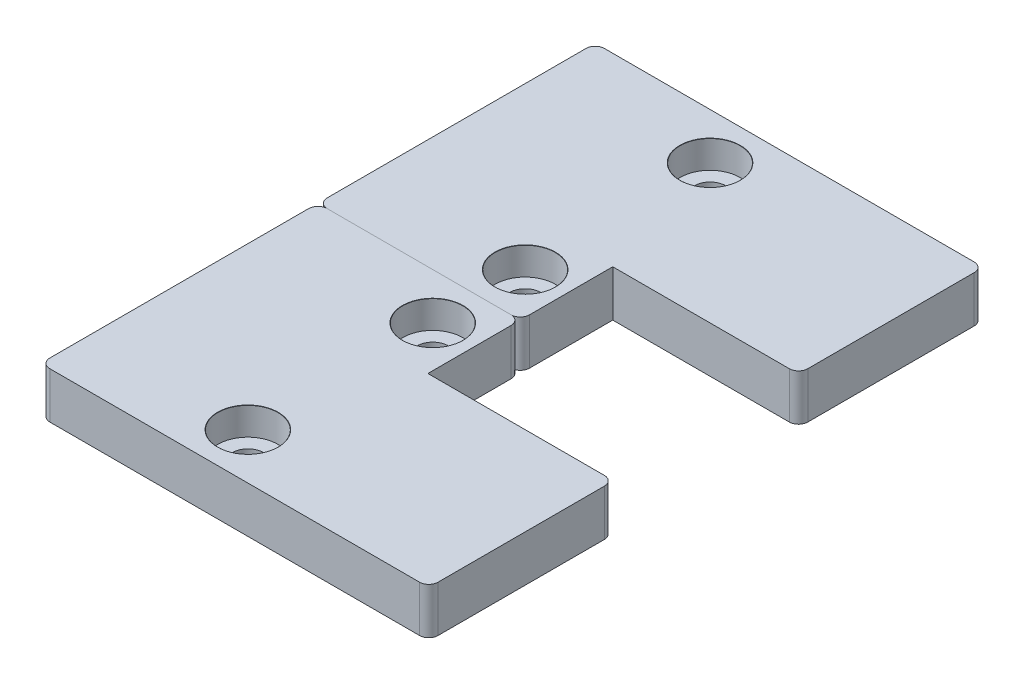
ISO-10303-21;
HEADER;
FILE_DESCRIPTION(('STEP AP214'),'2;1');
FILE_NAME('part.step','',(''),(''),'','','');
FILE_SCHEMA(('AUTOMOTIVE_DESIGN { 1 0 10303 214 1 1 1 1 }'));
ENDSEC;
DATA;
#1=APPLICATION_CONTEXT('core data for automotive mechanical design processes');
#2=APPLICATION_PROTOCOL_DEFINITION('international standard','automotive_design',2000,#1);
#3=PRODUCT_CONTEXT('',#1,'mechanical');
#4=PRODUCT('Part','Part','',(#3));
#5=PRODUCT_RELATED_PRODUCT_CATEGORY('part','',(#4));
#6=PRODUCT_DEFINITION_FORMATION('','',#4);
#7=PRODUCT_DEFINITION_CONTEXT('part definition',#1,'design');
#8=PRODUCT_DEFINITION('design','',#6,#7);
#9=PRODUCT_DEFINITION_SHAPE('','',#8);
#10=(LENGTH_UNIT() NAMED_UNIT(*) SI_UNIT(.MILLI.,.METRE.));
#11=(NAMED_UNIT(*) PLANE_ANGLE_UNIT() SI_UNIT($,.RADIAN.));
#12=(NAMED_UNIT(*) SI_UNIT($,.STERADIAN.) SOLID_ANGLE_UNIT());
#13=UNCERTAINTY_MEASURE_WITH_UNIT(LENGTH_MEASURE(1.E-05),#10,'distance_accuracy_value','');
#14=(GEOMETRIC_REPRESENTATION_CONTEXT(3) GLOBAL_UNCERTAINTY_ASSIGNED_CONTEXT((#13)) GLOBAL_UNIT_ASSIGNED_CONTEXT((#10,
#11,#12)) REPRESENTATION_CONTEXT('',''));
#15=CARTESIAN_POINT('',(0.,0.,0.));
#16=DIRECTION('',(0.,0.,1.));
#17=DIRECTION('',(1.,0.,0.));
#18=AXIS2_PLACEMENT_3D('',#15,#16,#17);
#19=CARTESIAN_POINT('',(-21.,5.,-30.));
#20=DIRECTION('',(1.,0.,0.));
#21=DIRECTION('',(0.,0.,1.));
#22=AXIS2_PLACEMENT_3D('',#19,#20,#21);
#23=PLANE('',#22);
#24=DIRECTION('',(0.,0.,-1.));
#25=VECTOR('',#24,1.);
#26=CARTESIAN_POINT('',(-21.,5.,-30.));
#27=LINE('',#26,#25);
#28=CARTESIAN_POINT('',(-21.,5.,-21.));
#29=VERTEX_POINT('',#28);
#30=CARTESIAN_POINT('',(-21.,5.,-49.));
#31=VERTEX_POINT('',#30);
#32=EDGE_CURVE('E155',#29,#31,#27,.T.);
#33=ORIENTED_EDGE('',*,*,#32,.T.);
#34=DIRECTION('',(0.,-1.,0.));
#35=VECTOR('',#34,1.);
#36=CARTESIAN_POINT('',(-21.,5.,-49.));
#37=LINE('',#36,#35);
#38=CARTESIAN_POINT('',(-21.,0.,-49.));
#39=VERTEX_POINT('',#38);
#40=EDGE_CURVE('E196',#39,#31,#37,.F.);
#41=ORIENTED_EDGE('',*,*,#40,.F.);
#42=DIRECTION('',(0.,0.,-1.));
#43=VECTOR('',#42,1.);
#44=CARTESIAN_POINT('',(-21.,0.,-30.));
#45=LINE('',#44,#43);
#46=CARTESIAN_POINT('',(-21.,0.,-21.));
#47=VERTEX_POINT('',#46);
#48=EDGE_CURVE('E161',#47,#39,#45,.T.);
#49=ORIENTED_EDGE('',*,*,#48,.F.);
#50=DIRECTION('',(0.,1.,0.));
#51=VECTOR('',#50,1.);
#52=CARTESIAN_POINT('',(-21.,0.,-21.));
#53=LINE('',#52,#51);
#54=EDGE_CURVE('E199',#29,#47,#53,.F.);
#55=ORIENTED_EDGE('',*,*,#54,.F.);
#56=EDGE_LOOP('',(#33,#41,#49,#55));
#57=FACE_BOUND('',#56,.T.);
#58=ADVANCED_FACE('F50',(#57),#23,.F.);
#59=CARTESIAN_POINT('',(21.,5.,-50.));
#60=DIRECTION('',(0.,0.,1.));
#61=DIRECTION('',(-1.,0.,0.));
#62=AXIS2_PLACEMENT_3D('',#59,#60,#61);
#63=PLANE('',#62);
#64=DIRECTION('',(1.,0.,0.));
#65=VECTOR('',#64,1.);
#66=CARTESIAN_POINT('',(21.,0.,-50.));
#67=LINE('',#66,#65);
#68=CARTESIAN_POINT('',(-20.,0.,-50.));
#69=VERTEX_POINT('',#68);
#70=CARTESIAN_POINT('',(20.,0.,-50.));
#71=VERTEX_POINT('',#70);
#72=EDGE_CURVE('E163',#69,#71,#67,.T.);
#73=ORIENTED_EDGE('',*,*,#72,.F.);
#74=DIRECTION('',(0.,-1.,0.));
#75=VECTOR('',#74,1.);
#76=CARTESIAN_POINT('',(-20.,5.,-50.));
#77=LINE('',#76,#75);
#78=CARTESIAN_POINT('',(-20.,5.,-50.));
#79=VERTEX_POINT('',#78);
#80=EDGE_CURVE('E58',#79,#69,#77,.T.);
#81=ORIENTED_EDGE('',*,*,#80,.F.);
#82=DIRECTION('',(1.,0.,0.));
#83=VECTOR('',#82,1.);
#84=CARTESIAN_POINT('',(21.,5.,-50.));
#85=LINE('',#84,#83);
#86=CARTESIAN_POINT('',(20.,5.,-50.));
#87=VERTEX_POINT('',#86);
#88=EDGE_CURVE('E172',#79,#87,#85,.T.);
#89=ORIENTED_EDGE('',*,*,#88,.T.);
#90=DIRECTION('',(0.,-1.,0.));
#91=VECTOR('',#90,1.);
#92=CARTESIAN_POINT('',(20.,5.,-50.));
#93=LINE('',#92,#91);
#94=EDGE_CURVE('E12',#71,#87,#93,.F.);
#95=ORIENTED_EDGE('',*,*,#94,.F.);
#96=EDGE_LOOP('',(#73,#81,#89,#95));
#97=FACE_BOUND('',#96,.T.);
#98=ADVANCED_FACE('F222',(#97),#63,.F.);
#99=CARTESIAN_POINT('',(21.,5.,-30.));
#100=DIRECTION('',(-1.,0.,0.));
#101=DIRECTION('',(0.,0.,-1.));
#102=AXIS2_PLACEMENT_3D('',#99,#100,#101);
#103=PLANE('',#102);
#104=DIRECTION('',(0.,0.,1.));
#105=VECTOR('',#104,1.);
#106=CARTESIAN_POINT('',(21.,0.,-30.));
#107=LINE('',#106,#105);
#108=CARTESIAN_POINT('',(21.,0.,-49.));
#109=VERTEX_POINT('',#108);
#110=CARTESIAN_POINT('',(21.,0.,-31.));
#111=VERTEX_POINT('',#110);
#112=EDGE_CURVE('E156',#109,#111,#107,.T.);
#113=ORIENTED_EDGE('',*,*,#112,.F.);
#114=DIRECTION('',(0.,-1.,0.));
#115=VECTOR('',#114,1.);
#116=CARTESIAN_POINT('',(21.,5.,-49.));
#117=LINE('',#116,#115);
#118=CARTESIAN_POINT('',(21.,5.,-49.));
#119=VERTEX_POINT('',#118);
#120=EDGE_CURVE('E213',#119,#109,#117,.T.);
#121=ORIENTED_EDGE('',*,*,#120,.F.);
#122=DIRECTION('',(0.,0.,1.));
#123=VECTOR('',#122,1.);
#124=CARTESIAN_POINT('',(21.,5.,-30.));
#125=LINE('',#124,#123);
#126=CARTESIAN_POINT('',(21.,5.,-31.));
#127=VERTEX_POINT('',#126);
#128=EDGE_CURVE('E175',#119,#127,#125,.T.);
#129=ORIENTED_EDGE('',*,*,#128,.T.);
#130=DIRECTION('',(0.,-1.,0.));
#131=VECTOR('',#130,1.);
#132=CARTESIAN_POINT('',(21.,5.,-31.));
#133=LINE('',#132,#131);
#134=EDGE_CURVE('E215',#111,#127,#133,.F.);
#135=ORIENTED_EDGE('',*,*,#134,.F.);
#136=EDGE_LOOP('',(#113,#121,#129,#135));
#137=FACE_BOUND('',#136,.T.);
#138=ADVANCED_FACE('F229',(#137),#103,.F.);
#139=CARTESIAN_POINT('',(21.,5.,-30.));
#140=DIRECTION('',(0.,0.,-1.));
#141=DIRECTION('',(1.,0.,0.));
#142=AXIS2_PLACEMENT_3D('',#139,#140,#141);
#143=PLANE('',#142);
#144=DIRECTION('',(-1.,0.,0.));
#145=VECTOR('',#144,1.);
#146=CARTESIAN_POINT('',(21.,5.,-30.));
#147=LINE('',#146,#145);
#148=CARTESIAN_POINT('',(20.,5.,-30.));
#149=VERTEX_POINT('',#148);
#150=CARTESIAN_POINT('',(0.900000000000001,5.,-30.));
#151=VERTEX_POINT('',#150);
#152=EDGE_CURVE('E160',#149,#151,#147,.T.);
#153=ORIENTED_EDGE('',*,*,#152,.T.);
#154=DIRECTION('',(0.,1.,0.));
#155=VECTOR('',#154,1.);
#156=CARTESIAN_POINT('',(0.900000000000001,0.,-30.));
#157=LINE('',#156,#155);
#158=CARTESIAN_POINT('',(0.900000000000001,0.,-30.));
#159=VERTEX_POINT('',#158);
#160=EDGE_CURVE('E139',#159,#151,#157,.T.);
#161=ORIENTED_EDGE('',*,*,#160,.F.);
#162=DIRECTION('',(-1.,0.,0.));
#163=VECTOR('',#162,1.);
#164=CARTESIAN_POINT('',(21.,0.,-30.));
#165=LINE('',#164,#163);
#166=CARTESIAN_POINT('',(20.,0.,-30.));
#167=VERTEX_POINT('',#166);
#168=EDGE_CURVE('E148',#167,#159,#165,.T.);
#169=ORIENTED_EDGE('',*,*,#168,.F.);
#170=DIRECTION('',(0.,-1.,0.));
#171=VECTOR('',#170,1.);
#172=CARTESIAN_POINT('',(20.,5.,-30.));
#173=LINE('',#172,#171);
#174=EDGE_CURVE('E211',#149,#167,#173,.T.);
#175=ORIENTED_EDGE('',*,*,#174,.F.);
#176=EDGE_LOOP('',(#153,#161,#169,#175));
#177=FACE_BOUND('',#176,.T.);
#178=ADVANCED_FACE('F158',(#177),#143,.F.);
#179=CARTESIAN_POINT('',(0.,5.,-40.));
#180=DIRECTION('',(0.,-1.,0.));
#181=DIRECTION('',(0.,0.,1.));
#182=AXIS2_PLACEMENT_3D('',#179,#180,#181);
#183=PLANE('',#182);
#184=CARTESIAN_POINT('',(-3.575,5.,-25.));
#185=DIRECTION('',(0.,-1.,0.));
#186=DIRECTION('',(0.,0.,-1.));
#187=AXIS2_PLACEMENT_3D('',#184,#185,#186);
#188=CIRCLE('',#187,3.275);
#189=CARTESIAN_POINT('',(-3.575,5.,-28.275));
#190=VERTEX_POINT('',#189);
#191=EDGE_CURVE('E266',#190,#190,#188,.T.);
#192=ORIENTED_EDGE('',*,*,#191,.T.);
#193=EDGE_LOOP('',(#192));
#194=FACE_BOUND('',#193,.T.);
#195=CARTESIAN_POINT('',(-3.57499999999999,5.,-45.));
#196=DIRECTION('',(0.,-1.,0.));
#197=DIRECTION('',(0.,0.,-1.));
#198=AXIS2_PLACEMENT_3D('',#195,#196,#197);
#199=CIRCLE('',#198,3.275);
#200=CARTESIAN_POINT('',(-3.57499999999999,5.,-48.275));
#201=VERTEX_POINT('',#200);
#202=EDGE_CURVE('E251',#201,#201,#199,.T.);
#203=ORIENTED_EDGE('',*,*,#202,.T.);
#204=EDGE_LOOP('',(#203));
#205=FACE_BOUND('',#204,.T.);
#206=DIRECTION('',(-1.,0.,0.));
#207=VECTOR('',#206,1.);
#208=CARTESIAN_POINT('',(-21.,5.,-20.));
#209=LINE('',#208,#207);
#210=CARTESIAN_POINT('',(-0.0999999999999994,5.,-20.));
#211=VERTEX_POINT('',#210);
#212=CARTESIAN_POINT('',(-20.,5.,-20.));
#213=VERTEX_POINT('',#212);
#214=EDGE_CURVE('E145',#211,#213,#209,.T.);
#215=ORIENTED_EDGE('',*,*,#214,.F.);
#216=CARTESIAN_POINT('',(-0.0999999999999985,5.,-21.));
#217=DIRECTION('',(0.,1.,0.));
#218=DIRECTION('',(0.,0.,1.));
#219=AXIS2_PLACEMENT_3D('',#216,#217,#218);
#220=CIRCLE('',#219,1.);
#221=CARTESIAN_POINT('',(0.900000000000001,5.,-21.));
#222=VERTEX_POINT('',#221);
#223=EDGE_CURVE('E191',#222,#211,#220,.F.);
#224=ORIENTED_EDGE('',*,*,#223,.F.);
#225=DIRECTION('',(0.,0.,1.));
#226=VECTOR('',#225,1.);
#227=CARTESIAN_POINT('',(0.900000000000001,5.,-30.));
#228=LINE('',#227,#226);
#229=EDGE_CURVE('E236',#151,#222,#228,.T.);
#230=ORIENTED_EDGE('',*,*,#229,.F.);
#231=ORIENTED_EDGE('',*,*,#152,.F.);
#232=CARTESIAN_POINT('',(20.,5.,-31.));
#233=DIRECTION('',(0.,1.,0.));
#234=DIRECTION('',(0.,0.,1.));
#235=AXIS2_PLACEMENT_3D('',#232,#233,#234);
#236=CIRCLE('',#235,1.);
#237=EDGE_CURVE('E189',#127,#149,#236,.F.);
#238=ORIENTED_EDGE('',*,*,#237,.F.);
#239=ORIENTED_EDGE('',*,*,#128,.F.);
#240=CARTESIAN_POINT('',(20.,5.,-49.));
#241=DIRECTION('',(0.,1.,0.));
#242=DIRECTION('',(0.,0.,1.));
#243=AXIS2_PLACEMENT_3D('',#240,#241,#242);
#244=CIRCLE('',#243,1.);
#245=EDGE_CURVE('E187',#87,#119,#244,.F.);
#246=ORIENTED_EDGE('',*,*,#245,.F.);
#247=ORIENTED_EDGE('',*,*,#88,.F.);
#248=CARTESIAN_POINT('',(-20.,5.,-49.));
#249=DIRECTION('',(0.,1.,0.));
#250=DIRECTION('',(0.,0.,1.));
#251=AXIS2_PLACEMENT_3D('',#248,#249,#250);
#252=CIRCLE('',#251,1.);
#253=EDGE_CURVE('E185',#31,#79,#252,.F.);
#254=ORIENTED_EDGE('',*,*,#253,.F.);
#255=ORIENTED_EDGE('',*,*,#32,.F.);
#256=CARTESIAN_POINT('',(-20.,5.,-21.));
#257=DIRECTION('',(0.,1.,0.));
#258=DIRECTION('',(0.,0.,1.));
#259=AXIS2_PLACEMENT_3D('',#256,#257,#258);
#260=CIRCLE('',#259,1.);
#261=EDGE_CURVE('E194',#213,#29,#260,.F.);
#262=ORIENTED_EDGE('',*,*,#261,.F.);
#263=EDGE_LOOP('',(#215,#224,#230,#231,#238,#239,#246,#247,#254,#255,#262));
#264=FACE_BOUND('',#263,.T.);
#265=ADVANCED_FACE('F234',(#194,#205,#264),#183,.F.);
#266=CARTESIAN_POINT('',(0.,0.,-40.));
#267=DIRECTION('',(0.,-1.,0.));
#268=DIRECTION('',(0.,0.,1.));
#269=AXIS2_PLACEMENT_3D('',#266,#267,#268);
#270=PLANE('',#269);
#271=CARTESIAN_POINT('',(-3.575,0.,-25.));
#272=DIRECTION('',(0.,-1.,0.));
#273=DIRECTION('',(0.,0.,-1.));
#274=AXIS2_PLACEMENT_3D('',#271,#272,#273);
#275=CIRCLE('',#274,1.7);
#276=CARTESIAN_POINT('',(-3.575,0.,-26.7));
#277=VERTEX_POINT('',#276);
#278=EDGE_CURVE('E254',#277,#277,#275,.T.);
#279=ORIENTED_EDGE('',*,*,#278,.F.);
#280=EDGE_LOOP('',(#279));
#281=FACE_BOUND('',#280,.T.);
#282=CARTESIAN_POINT('',(-3.57499999999999,0.,-45.));
#283=DIRECTION('',(0.,-1.,0.));
#284=DIRECTION('',(0.,0.,-1.));
#285=AXIS2_PLACEMENT_3D('',#282,#283,#284);
#286=CIRCLE('',#285,1.7);
#287=CARTESIAN_POINT('',(-3.57499999999999,0.,-46.7));
#288=VERTEX_POINT('',#287);
#289=EDGE_CURVE('E237',#288,#288,#286,.T.);
#290=ORIENTED_EDGE('',*,*,#289,.F.);
#291=EDGE_LOOP('',(#290));
#292=FACE_BOUND('',#291,.T.);
#293=ORIENTED_EDGE('',*,*,#48,.T.);
#294=CARTESIAN_POINT('',(-20.,0.,-49.));
#295=DIRECTION('',(0.,1.,0.));
#296=DIRECTION('',(0.,0.,1.));
#297=AXIS2_PLACEMENT_3D('',#294,#295,#296);
#298=CIRCLE('',#297,1.);
#299=EDGE_CURVE('E72',#69,#39,#298,.T.);
#300=ORIENTED_EDGE('',*,*,#299,.F.);
#301=ORIENTED_EDGE('',*,*,#72,.T.);
#302=CARTESIAN_POINT('',(20.,0.,-49.));
#303=DIRECTION('',(0.,1.,0.));
#304=DIRECTION('',(0.,0.,1.));
#305=AXIS2_PLACEMENT_3D('',#302,#303,#304);
#306=CIRCLE('',#305,1.);
#307=EDGE_CURVE('E64',#109,#71,#306,.T.);
#308=ORIENTED_EDGE('',*,*,#307,.F.);
#309=ORIENTED_EDGE('',*,*,#112,.T.);
#310=CARTESIAN_POINT('',(20.,0.,-31.));
#311=DIRECTION('',(0.,1.,0.));
#312=DIRECTION('',(0.,0.,1.));
#313=AXIS2_PLACEMENT_3D('',#310,#311,#312);
#314=CIRCLE('',#313,1.);
#315=EDGE_CURVE('E151',#167,#111,#314,.T.);
#316=ORIENTED_EDGE('',*,*,#315,.F.);
#317=ORIENTED_EDGE('',*,*,#168,.T.);
#318=DIRECTION('',(0.,0.,1.));
#319=VECTOR('',#318,1.);
#320=CARTESIAN_POINT('',(0.900000000000001,0.,-30.));
#321=LINE('',#320,#319);
#322=CARTESIAN_POINT('',(0.900000000000001,0.,-21.));
#323=VERTEX_POINT('',#322);
#324=EDGE_CURVE('E134',#159,#323,#321,.T.);
#325=ORIENTED_EDGE('',*,*,#324,.T.);
#326=CARTESIAN_POINT('',(-0.0999999999999985,0.,-21.));
#327=DIRECTION('',(0.,1.,0.));
#328=DIRECTION('',(0.,0.,1.));
#329=AXIS2_PLACEMENT_3D('',#326,#327,#328);
#330=CIRCLE('',#329,1.);
#331=CARTESIAN_POINT('',(-0.0999999999999994,0.,-20.));
#332=VERTEX_POINT('',#331);
#333=EDGE_CURVE('E205',#332,#323,#330,.T.);
#334=ORIENTED_EDGE('',*,*,#333,.F.);
#335=DIRECTION('',(-1.,0.,0.));
#336=VECTOR('',#335,1.);
#337=CARTESIAN_POINT('',(-21.,0.,-20.));
#338=LINE('',#337,#336);
#339=CARTESIAN_POINT('',(-20.,0.,-20.));
#340=VERTEX_POINT('',#339);
#341=EDGE_CURVE('E144',#332,#340,#338,.T.);
#342=ORIENTED_EDGE('',*,*,#341,.T.);
#343=CARTESIAN_POINT('',(-20.,0.,-21.));
#344=DIRECTION('',(0.,1.,0.));
#345=DIRECTION('',(0.,0.,1.));
#346=AXIS2_PLACEMENT_3D('',#343,#344,#345);
#347=CIRCLE('',#346,1.);
#348=EDGE_CURVE('E207',#47,#340,#347,.T.);
#349=ORIENTED_EDGE('',*,*,#348,.F.);
#350=EDGE_LOOP('',(#293,#300,#301,#308,#309,#316,#317,#325,#334,#342,#349));
#351=FACE_BOUND('',#350,.T.);
#352=ADVANCED_FACE('F149',(#281,#292,#351),#270,.T.);
#353=CARTESIAN_POINT('',(-21.,0.,-20.));
#354=DIRECTION('',(0.,0.,1.));
#355=DIRECTION('',(-1.,0.,0.));
#356=AXIS2_PLACEMENT_3D('',#353,#354,#355);
#357=PLANE('',#356);
#358=ORIENTED_EDGE('',*,*,#341,.F.);
#359=DIRECTION('',(0.,1.,0.));
#360=VECTOR('',#359,1.);
#361=CARTESIAN_POINT('',(-0.0999999999999994,0.,-20.));
#362=LINE('',#361,#360);
#363=EDGE_CURVE('E178',#211,#332,#362,.F.);
#364=ORIENTED_EDGE('',*,*,#363,.F.);
#365=ORIENTED_EDGE('',*,*,#214,.T.);
#366=DIRECTION('',(0.,1.,0.));
#367=VECTOR('',#366,1.);
#368=CARTESIAN_POINT('',(-20.,5.,-20.));
#369=LINE('',#368,#367);
#370=EDGE_CURVE('E183',#340,#213,#369,.T.);
#371=ORIENTED_EDGE('',*,*,#370,.F.);
#372=EDGE_LOOP('',(#358,#364,#365,#371));
#373=FACE_BOUND('',#372,.T.);
#374=ADVANCED_FACE('F423',(#373),#357,.T.);
#375=CARTESIAN_POINT('',(0.900000000000001,0.,-30.));
#376=DIRECTION('',(1.,0.,0.));
#377=DIRECTION('',(0.,0.,1.));
#378=AXIS2_PLACEMENT_3D('',#375,#376,#377);
#379=PLANE('',#378);
#380=ORIENTED_EDGE('',*,*,#324,.F.);
#381=ORIENTED_EDGE('',*,*,#160,.T.);
#382=ORIENTED_EDGE('',*,*,#229,.T.);
#383=DIRECTION('',(0.,1.,0.));
#384=VECTOR('',#383,1.);
#385=CARTESIAN_POINT('',(0.900000000000001,0.,-21.));
#386=LINE('',#385,#384);
#387=EDGE_CURVE('E141',#323,#222,#386,.T.);
#388=ORIENTED_EDGE('',*,*,#387,.F.);
#389=EDGE_LOOP('',(#380,#381,#382,#388));
#390=FACE_BOUND('',#389,.T.);
#391=ADVANCED_FACE('F136',(#390),#379,.T.);
#392=CARTESIAN_POINT('',(-3.57499999999999,5.,-45.));
#393=DIRECTION('',(0.,1.,0.));
#394=DIRECTION('',(0.,0.,-1.));
#395=AXIS2_PLACEMENT_3D('',#392,#393,#394);
#396=CYLINDRICAL_SURFACE('',#395,1.7);
#397=ORIENTED_EDGE('',*,*,#289,.T.);
#398=EDGE_LOOP('',(#397));
#399=FACE_BOUND('',#398,.T.);
#400=CARTESIAN_POINT('',(-3.57499999999999,2.,-45.));
#401=DIRECTION('',(0.,-1.,0.));
#402=DIRECTION('',(0.,0.,-1.));
#403=AXIS2_PLACEMENT_3D('',#400,#401,#402);
#404=CIRCLE('',#403,1.7);
#405=CARTESIAN_POINT('',(-3.57499999999999,2.,-46.7));
#406=VERTEX_POINT('',#405);
#407=EDGE_CURVE('E240',#406,#406,#404,.T.);
#408=ORIENTED_EDGE('',*,*,#407,.F.);
#409=EDGE_LOOP('',(#408));
#410=FACE_BOUND('',#409,.T.);
#411=ADVANCED_FACE('F402',(#399,#410),#396,.F.);
#412=CARTESIAN_POINT('',(-0.324999999999995,2.,-45.));
#413=DIRECTION('',(0.,-1.,0.));
#414=DIRECTION('',(0.,0.,1.));
#415=AXIS2_PLACEMENT_3D('',#412,#413,#414);
#416=PLANE('',#415);
#417=ORIENTED_EDGE('',*,*,#407,.T.);
#418=EDGE_LOOP('',(#417));
#419=FACE_BOUND('',#418,.T.);
#420=CARTESIAN_POINT('',(-3.57499999999999,2.,-45.));
#421=DIRECTION('',(0.,-1.,0.));
#422=DIRECTION('',(0.,0.,-1.));
#423=AXIS2_PLACEMENT_3D('',#420,#421,#422);
#424=CIRCLE('',#423,3.25);
#425=CARTESIAN_POINT('',(-3.57499999999999,2.,-48.25));
#426=VERTEX_POINT('',#425);
#427=EDGE_CURVE('E245',#426,#426,#424,.T.);
#428=ORIENTED_EDGE('',*,*,#427,.F.);
#429=EDGE_LOOP('',(#428));
#430=FACE_BOUND('',#429,.T.);
#431=ADVANCED_FACE('F391',(#419,#430),#416,.F.);
#432=CARTESIAN_POINT('',(-3.57499999999999,5.,-45.));
#433=DIRECTION('',(0.,1.,0.));
#434=DIRECTION('',(0.,0.,-1.));
#435=AXIS2_PLACEMENT_3D('',#432,#433,#434);
#436=CYLINDRICAL_SURFACE('',#435,3.25);
#437=ORIENTED_EDGE('',*,*,#427,.T.);
#438=EDGE_LOOP('',(#437));
#439=FACE_BOUND('',#438,.T.);
#440=CARTESIAN_POINT('',(-3.57499999999999,4.97902250922057,-45.));
#441=DIRECTION('',(0.,-1.,0.));
#442=DIRECTION('',(0.,0.,-1.));
#443=AXIS2_PLACEMENT_3D('',#440,#441,#442);
#444=CIRCLE('',#443,3.25);
#445=CARTESIAN_POINT('',(-3.57499999999999,4.97902250922057,-48.25));
#446=VERTEX_POINT('',#445);
#447=EDGE_CURVE('E248',#446,#446,#444,.T.);
#448=ORIENTED_EDGE('',*,*,#447,.F.);
#449=EDGE_LOOP('',(#448));
#450=FACE_BOUND('',#449,.T.);
#451=ADVANCED_FACE('F380',(#439,#450),#436,.F.);
#452=CARTESIAN_POINT('',(-3.57499999999999,5.,-45.));
#453=DIRECTION('',(0.,1.,0.));
#454=DIRECTION('',(0.,0.,-1.));
#455=AXIS2_PLACEMENT_3D('',#452,#453,#454);
#456=CONICAL_SURFACE('',#455,3.275,0.87266462599717);
#457=ORIENTED_EDGE('',*,*,#447,.T.);
#458=EDGE_LOOP('',(#457));
#459=FACE_BOUND('',#458,.T.);
#460=ORIENTED_EDGE('',*,*,#202,.F.);
#461=EDGE_LOOP('',(#460));
#462=FACE_BOUND('',#461,.T.);
#463=ADVANCED_FACE('F369',(#459,#462),#456,.F.);
#464=CARTESIAN_POINT('',(-3.575,5.,-25.));
#465=DIRECTION('',(0.,1.,0.));
#466=DIRECTION('',(0.,0.,-1.));
#467=AXIS2_PLACEMENT_3D('',#464,#465,#466);
#468=CYLINDRICAL_SURFACE('',#467,1.7);
#469=ORIENTED_EDGE('',*,*,#278,.T.);
#470=EDGE_LOOP('',(#469));
#471=FACE_BOUND('',#470,.T.);
#472=CARTESIAN_POINT('',(-3.575,2.,-25.));
#473=DIRECTION('',(0.,-1.,0.));
#474=DIRECTION('',(0.,0.,-1.));
#475=AXIS2_PLACEMENT_3D('',#472,#473,#474);
#476=CIRCLE('',#475,1.7);
#477=CARTESIAN_POINT('',(-3.575,2.,-26.7));
#478=VERTEX_POINT('',#477);
#479=EDGE_CURVE('E257',#478,#478,#476,.T.);
#480=ORIENTED_EDGE('',*,*,#479,.F.);
#481=EDGE_LOOP('',(#480));
#482=FACE_BOUND('',#481,.T.);
#483=ADVANCED_FACE('F358',(#471,#482),#468,.F.);
#484=CARTESIAN_POINT('',(-0.325000000000001,2.,-25.));
#485=DIRECTION('',(0.,-1.,0.));
#486=DIRECTION('',(0.,0.,1.));
#487=AXIS2_PLACEMENT_3D('',#484,#485,#486);
#488=PLANE('',#487);
#489=ORIENTED_EDGE('',*,*,#479,.T.);
#490=EDGE_LOOP('',(#489));
#491=FACE_BOUND('',#490,.T.);
#492=CARTESIAN_POINT('',(-3.575,2.,-25.));
#493=DIRECTION('',(0.,-1.,0.));
#494=DIRECTION('',(0.,0.,-1.));
#495=AXIS2_PLACEMENT_3D('',#492,#493,#494);
#496=CIRCLE('',#495,3.25);
#497=CARTESIAN_POINT('',(-3.575,2.,-28.25));
#498=VERTEX_POINT('',#497);
#499=EDGE_CURVE('E260',#498,#498,#496,.T.);
#500=ORIENTED_EDGE('',*,*,#499,.F.);
#501=EDGE_LOOP('',(#500));
#502=FACE_BOUND('',#501,.T.);
#503=ADVANCED_FACE('F285',(#491,#502),#488,.F.);
#504=CARTESIAN_POINT('',(-3.575,5.,-25.));
#505=DIRECTION('',(0.,1.,0.));
#506=DIRECTION('',(0.,0.,-1.));
#507=AXIS2_PLACEMENT_3D('',#504,#505,#506);
#508=CYLINDRICAL_SURFACE('',#507,3.25);
#509=ORIENTED_EDGE('',*,*,#499,.T.);
#510=EDGE_LOOP('',(#509));
#511=FACE_BOUND('',#510,.T.);
#512=CARTESIAN_POINT('',(-3.575,4.97902250922057,-25.));
#513=DIRECTION('',(0.,-1.,0.));
#514=DIRECTION('',(0.,0.,-1.));
#515=AXIS2_PLACEMENT_3D('',#512,#513,#514);
#516=CIRCLE('',#515,3.25);
#517=CARTESIAN_POINT('',(-3.575,4.97902250922057,-28.25));
#518=VERTEX_POINT('',#517);
#519=EDGE_CURVE('E263',#518,#518,#516,.T.);
#520=ORIENTED_EDGE('',*,*,#519,.F.);
#521=EDGE_LOOP('',(#520));
#522=FACE_BOUND('',#521,.T.);
#523=ADVANCED_FACE('F275',(#511,#522),#508,.F.);
#524=CARTESIAN_POINT('',(-3.575,5.,-25.));
#525=DIRECTION('',(0.,1.,0.));
#526=DIRECTION('',(0.,0.,-1.));
#527=AXIS2_PLACEMENT_3D('',#524,#525,#526);
#528=CONICAL_SURFACE('',#527,3.275,0.87266462599717);
#529=ORIENTED_EDGE('',*,*,#519,.T.);
#530=EDGE_LOOP('',(#529));
#531=FACE_BOUND('',#530,.T.);
#532=ORIENTED_EDGE('',*,*,#191,.F.);
#533=EDGE_LOOP('',(#532));
#534=FACE_BOUND('',#533,.T.);
#535=ADVANCED_FACE('F272',(#531,#534),#528,.F.);
#536=CARTESIAN_POINT('',(-20.,0.,-21.));
#537=DIRECTION('',(0.,-1.,0.));
#538=DIRECTION('',(0.,0.,1.));
#539=AXIS2_PLACEMENT_3D('',#536,#537,#538);
#540=CYLINDRICAL_SURFACE('',#539,1.);
#541=ORIENTED_EDGE('',*,*,#348,.T.);
#542=ORIENTED_EDGE('',*,*,#370,.T.);
#543=ORIENTED_EDGE('',*,*,#261,.T.);
#544=ORIENTED_EDGE('',*,*,#54,.T.);
#545=EDGE_LOOP('',(#541,#542,#543,#544));
#546=FACE_BOUND('',#545,.T.);
#547=ADVANCED_FACE('F274',(#546),#540,.T.);
#548=CARTESIAN_POINT('',(-0.0999999999999985,0.,-21.));
#549=DIRECTION('',(0.,1.,0.));
#550=DIRECTION('',(0.,0.,-1.));
#551=AXIS2_PLACEMENT_3D('',#548,#549,#550);
#552=CYLINDRICAL_SURFACE('',#551,1.);
#553=ORIENTED_EDGE('',*,*,#333,.T.);
#554=ORIENTED_EDGE('',*,*,#387,.T.);
#555=ORIENTED_EDGE('',*,*,#223,.T.);
#556=ORIENTED_EDGE('',*,*,#363,.T.);
#557=EDGE_LOOP('',(#553,#554,#555,#556));
#558=FACE_BOUND('',#557,.T.);
#559=ADVANCED_FACE('F282',(#558),#552,.T.);
#560=CARTESIAN_POINT('',(20.,5.,-31.));
#561=DIRECTION('',(0.,-1.,0.));
#562=DIRECTION('',(0.,0.,1.));
#563=AXIS2_PLACEMENT_3D('',#560,#561,#562);
#564=CYLINDRICAL_SURFACE('',#563,1.);
#565=ORIENTED_EDGE('',*,*,#237,.T.);
#566=ORIENTED_EDGE('',*,*,#174,.T.);
#567=ORIENTED_EDGE('',*,*,#315,.T.);
#568=ORIENTED_EDGE('',*,*,#134,.T.);
#569=EDGE_LOOP('',(#565,#566,#567,#568));
#570=FACE_BOUND('',#569,.T.);
#571=ADVANCED_FACE('F231',(#570),#564,.T.);
#572=CARTESIAN_POINT('',(20.,5.,-49.));
#573=DIRECTION('',(0.,-1.,0.));
#574=DIRECTION('',(0.,0.,1.));
#575=AXIS2_PLACEMENT_3D('',#572,#573,#574);
#576=CYLINDRICAL_SURFACE('',#575,1.);
#577=ORIENTED_EDGE('',*,*,#245,.T.);
#578=ORIENTED_EDGE('',*,*,#120,.T.);
#579=ORIENTED_EDGE('',*,*,#307,.T.);
#580=ORIENTED_EDGE('',*,*,#94,.T.);
#581=EDGE_LOOP('',(#577,#578,#579,#580));
#582=FACE_BOUND('',#581,.T.);
#583=ADVANCED_FACE('F225',(#582),#576,.T.);
#584=CARTESIAN_POINT('',(-20.,5.,-49.));
#585=DIRECTION('',(0.,-1.,0.));
#586=DIRECTION('',(0.,0.,1.));
#587=AXIS2_PLACEMENT_3D('',#584,#585,#586);
#588=CYLINDRICAL_SURFACE('',#587,1.);
#589=ORIENTED_EDGE('',*,*,#253,.T.);
#590=ORIENTED_EDGE('',*,*,#80,.T.);
#591=ORIENTED_EDGE('',*,*,#299,.T.);
#592=ORIENTED_EDGE('',*,*,#40,.T.);
#593=EDGE_LOOP('',(#589,#590,#591,#592));
#594=FACE_BOUND('',#593,.T.);
#595=ADVANCED_FACE('F52',(#594),#588,.T.);
#596=CLOSED_SHELL('',(#58,#98,#138,#178,#265,#352,#374,#391,#411,#431,#451,#463,#483,#503,#523,
#535,#547,#559,#571,#583,#595));
#597=MANIFOLD_SOLID_BREP('B2',#596);
#598=CARTESIAN_POINT('',(-21.,5.,-10.));
#599=DIRECTION('',(1.,0.,0.));
#600=DIRECTION('',(0.,0.,-1.));
#601=AXIS2_PLACEMENT_3D('',#598,#599,#600);
#602=PLANE('',#601);
#603=DIRECTION('',(0.,0.,1.));
#604=VECTOR('',#603,1.);
#605=CARTESIAN_POINT('',(-21.,5.,-10.));
#606=LINE('',#605,#604);
#607=CARTESIAN_POINT('',(-21.,5.,-19.));
#608=VERTEX_POINT('',#607);
#609=CARTESIAN_POINT('',(-21.,5.,9.));
#610=VERTEX_POINT('',#609);
#611=EDGE_CURVE('E631',#608,#610,#606,.T.);
#612=ORIENTED_EDGE('',*,*,#611,.F.);
#613=DIRECTION('',(0.,1.,0.));
#614=VECTOR('',#613,1.);
#615=CARTESIAN_POINT('',(-21.,0.,-19.));
#616=LINE('',#615,#614);
#617=CARTESIAN_POINT('',(-21.,0.,-19.));
#618=VERTEX_POINT('',#617);
#619=EDGE_CURVE('E695',#608,#618,#616,.F.);
#620=ORIENTED_EDGE('',*,*,#619,.T.);
#621=DIRECTION('',(0.,0.,1.));
#622=VECTOR('',#621,1.);
#623=CARTESIAN_POINT('',(-21.,0.,-10.));
#624=LINE('',#623,#622);
#625=CARTESIAN_POINT('',(-21.,0.,9.));
#626=VERTEX_POINT('',#625);
#627=EDGE_CURVE('E643',#618,#626,#624,.T.);
#628=ORIENTED_EDGE('',*,*,#627,.T.);
#629=DIRECTION('',(0.,-1.,0.));
#630=VECTOR('',#629,1.);
#631=CARTESIAN_POINT('',(-21.,5.,9.));
#632=LINE('',#631,#630);
#633=EDGE_CURVE('E693',#626,#610,#632,.F.);
#634=ORIENTED_EDGE('',*,*,#633,.T.);
#635=EDGE_LOOP('',(#612,#620,#628,#634));
#636=FACE_BOUND('',#635,.T.);
#637=ADVANCED_FACE('F538',(#636),#602,.F.);
#638=CARTESIAN_POINT('',(21.,5.,10.));
#639=DIRECTION('',(0.,0.,-1.));
#640=DIRECTION('',(-1.,0.,0.));
#641=AXIS2_PLACEMENT_3D('',#638,#639,#640);
#642=PLANE('',#641);
#643=DIRECTION('',(1.,0.,0.));
#644=VECTOR('',#643,1.);
#645=CARTESIAN_POINT('',(21.,0.,10.));
#646=LINE('',#645,#644);
#647=CARTESIAN_POINT('',(-20.,0.,10.));
#648=VERTEX_POINT('',#647);
#649=CARTESIAN_POINT('',(20.,0.,10.));
#650=VERTEX_POINT('',#649);
#651=EDGE_CURVE('E675',#648,#650,#646,.T.);
#652=ORIENTED_EDGE('',*,*,#651,.T.);
#653=DIRECTION('',(0.,-1.,0.));
#654=VECTOR('',#653,1.);
#655=CARTESIAN_POINT('',(20.,5.,10.));
#656=LINE('',#655,#654);
#657=CARTESIAN_POINT('',(20.,5.,10.));
#658=VERTEX_POINT('',#657);
#659=EDGE_CURVE('E48',#650,#658,#656,.F.);
#660=ORIENTED_EDGE('',*,*,#659,.T.);
#661=DIRECTION('',(1.,0.,0.));
#662=VECTOR('',#661,1.);
#663=CARTESIAN_POINT('',(21.,5.,10.));
#664=LINE('',#663,#662);
#665=CARTESIAN_POINT('',(-20.,5.,10.));
#666=VERTEX_POINT('',#665);
#667=EDGE_CURVE('E664',#666,#658,#664,.T.);
#668=ORIENTED_EDGE('',*,*,#667,.F.);
#669=DIRECTION('',(0.,-1.,0.));
#670=VECTOR('',#669,1.);
#671=CARTESIAN_POINT('',(-20.,5.,10.));
#672=LINE('',#671,#670);
#673=EDGE_CURVE('E546',#666,#648,#672,.T.);
#674=ORIENTED_EDGE('',*,*,#673,.T.);
#675=EDGE_LOOP('',(#652,#660,#668,#674));
#676=FACE_BOUND('',#675,.T.);
#677=ADVANCED_FACE('F713',(#676),#642,.F.);
#678=CARTESIAN_POINT('',(21.,5.,-10.));
#679=DIRECTION('',(-1.,0.,0.));
#680=DIRECTION('',(0.,0.,1.));
#681=AXIS2_PLACEMENT_3D('',#678,#679,#680);
#682=PLANE('',#681);
#683=DIRECTION('',(0.,0.,-1.));
#684=VECTOR('',#683,1.);
#685=CARTESIAN_POINT('',(21.,0.,-10.));
#686=LINE('',#685,#684);
#687=CARTESIAN_POINT('',(21.,0.,9.));
#688=VERTEX_POINT('',#687);
#689=CARTESIAN_POINT('',(21.,0.,-9.));
#690=VERTEX_POINT('',#689);
#691=EDGE_CURVE('E632',#688,#690,#686,.T.);
#692=ORIENTED_EDGE('',*,*,#691,.T.);
#693=DIRECTION('',(0.,-1.,0.));
#694=VECTOR('',#693,1.);
#695=CARTESIAN_POINT('',(21.,5.,-9.));
#696=LINE('',#695,#694);
#697=CARTESIAN_POINT('',(21.,5.,-9.));
#698=VERTEX_POINT('',#697);
#699=EDGE_CURVE('E710',#690,#698,#696,.F.);
#700=ORIENTED_EDGE('',*,*,#699,.T.);
#701=DIRECTION('',(0.,0.,-1.));
#702=VECTOR('',#701,1.);
#703=CARTESIAN_POINT('',(21.,5.,-10.));
#704=LINE('',#703,#702);
#705=CARTESIAN_POINT('',(21.,5.,9.));
#706=VERTEX_POINT('',#705);
#707=EDGE_CURVE('E667',#706,#698,#704,.T.);
#708=ORIENTED_EDGE('',*,*,#707,.F.);
#709=DIRECTION('',(0.,-1.,0.));
#710=VECTOR('',#709,1.);
#711=CARTESIAN_POINT('',(21.,5.,9.));
#712=LINE('',#711,#710);
#713=EDGE_CURVE('E707',#706,#688,#712,.T.);
#714=ORIENTED_EDGE('',*,*,#713,.T.);
#715=EDGE_LOOP('',(#692,#700,#708,#714));
#716=FACE_BOUND('',#715,.T.);
#717=ADVANCED_FACE('F737',(#716),#682,.F.);
#718=CARTESIAN_POINT('',(21.,5.,-10.));
#719=DIRECTION('',(0.,0.,1.));
#720=DIRECTION('',(1.,0.,0.));
#721=AXIS2_PLACEMENT_3D('',#718,#719,#720);
#722=PLANE('',#721);
#723=DIRECTION('',(-1.,0.,0.));
#724=VECTOR('',#723,1.);
#725=CARTESIAN_POINT('',(21.,5.,-10.));
#726=LINE('',#725,#724);
#727=CARTESIAN_POINT('',(20.,5.,-10.));
#728=VERTEX_POINT('',#727);
#729=CARTESIAN_POINT('',(0.900000000000001,5.,-10.));
#730=VERTEX_POINT('',#729);
#731=EDGE_CURVE('E670',#728,#730,#726,.T.);
#732=ORIENTED_EDGE('',*,*,#731,.F.);
#733=DIRECTION('',(0.,-1.,0.));
#734=VECTOR('',#733,1.);
#735=CARTESIAN_POINT('',(20.,5.,-10.));
#736=LINE('',#735,#734);
#737=CARTESIAN_POINT('',(20.,0.,-10.));
#738=VERTEX_POINT('',#737);
#739=EDGE_CURVE('E629',#728,#738,#736,.T.);
#740=ORIENTED_EDGE('',*,*,#739,.T.);
#741=DIRECTION('',(-1.,0.,0.));
#742=VECTOR('',#741,1.);
#743=CARTESIAN_POINT('',(21.,0.,-10.));
#744=LINE('',#743,#742);
#745=CARTESIAN_POINT('',(0.900000000000001,0.,-10.));
#746=VERTEX_POINT('',#745);
#747=EDGE_CURVE('E623',#738,#746,#744,.T.);
#748=ORIENTED_EDGE('',*,*,#747,.T.);
#749=DIRECTION('',(0.,1.,0.));
#750=VECTOR('',#749,1.);
#751=CARTESIAN_POINT('',(0.900000000000001,0.,-10.));
#752=LINE('',#751,#750);
#753=EDGE_CURVE('E627',#746,#730,#752,.T.);
#754=ORIENTED_EDGE('',*,*,#753,.T.);
#755=EDGE_LOOP('',(#732,#740,#748,#754));
#756=FACE_BOUND('',#755,.T.);
#757=ADVANCED_FACE('F626',(#756),#722,.F.);
#758=CARTESIAN_POINT('',(0.,5.,0.));
#759=DIRECTION('',(0.,-1.,0.));
#760=DIRECTION('',(0.,0.,-1.));
#761=AXIS2_PLACEMENT_3D('',#758,#759,#760);
#762=PLANE('',#761);
#763=CARTESIAN_POINT('',(-3.575,5.,-15.));
#764=DIRECTION('',(0.,1.,0.));
#765=DIRECTION('',(0.,0.,1.));
#766=AXIS2_PLACEMENT_3D('',#763,#764,#765);
#767=CIRCLE('',#766,3.275);
#768=CARTESIAN_POINT('',(-3.575,5.,-11.725));
#769=VERTEX_POINT('',#768);
#770=EDGE_CURVE('E980',#769,#769,#767,.T.);
#771=ORIENTED_EDGE('',*,*,#770,.F.);
#772=EDGE_LOOP('',(#771));
#773=FACE_BOUND('',#772,.T.);
#774=CARTESIAN_POINT('',(-3.57499999999999,5.,5.));
#775=DIRECTION('',(0.,1.,0.));
#776=DIRECTION('',(0.,0.,1.));
#777=AXIS2_PLACEMENT_3D('',#774,#775,#776);
#778=CIRCLE('',#777,3.275);
#779=CARTESIAN_POINT('',(-3.57499999999999,5.,8.275));
#780=VERTEX_POINT('',#779);
#781=EDGE_CURVE('E983',#780,#780,#778,.T.);
#782=ORIENTED_EDGE('',*,*,#781,.F.);
#783=EDGE_LOOP('',(#782));
#784=FACE_BOUND('',#783,.T.);
#785=DIRECTION('',(-1.,0.,0.));
#786=VECTOR('',#785,1.);
#787=CARTESIAN_POINT('',(-21.,5.,-20.));
#788=LINE('',#787,#786);
#789=CARTESIAN_POINT('',(-0.0999999999999994,5.,-20.));
#790=VERTEX_POINT('',#789);
#791=CARTESIAN_POINT('',(-20.,5.,-20.));
#792=VERTEX_POINT('',#791);
#793=EDGE_CURVE('E651',#790,#792,#788,.T.);
#794=ORIENTED_EDGE('',*,*,#793,.T.);
#795=CARTESIAN_POINT('',(-20.,5.,-19.));
#796=DIRECTION('',(0.,-1.,0.));
#797=DIRECTION('',(0.,0.,-1.));
#798=AXIS2_PLACEMENT_3D('',#795,#796,#797);
#799=CIRCLE('',#798,1.);
#800=EDGE_CURVE('E691',#792,#608,#799,.F.);
#801=ORIENTED_EDGE('',*,*,#800,.T.);
#802=ORIENTED_EDGE('',*,*,#611,.T.);
#803=CARTESIAN_POINT('',(-20.,5.,9.));
#804=DIRECTION('',(0.,-1.,0.));
#805=DIRECTION('',(0.,0.,-1.));
#806=AXIS2_PLACEMENT_3D('',#803,#804,#805);
#807=CIRCLE('',#806,1.);
#808=EDGE_CURVE('E683',#610,#666,#807,.F.);
#809=ORIENTED_EDGE('',*,*,#808,.T.);
#810=ORIENTED_EDGE('',*,*,#667,.T.);
#811=CARTESIAN_POINT('',(20.,5.,9.));
#812=DIRECTION('',(0.,-1.,0.));
#813=DIRECTION('',(0.,0.,-1.));
#814=AXIS2_PLACEMENT_3D('',#811,#812,#813);
#815=CIRCLE('',#814,1.);
#816=EDGE_CURVE('E685',#658,#706,#815,.F.);
#817=ORIENTED_EDGE('',*,*,#816,.T.);
#818=ORIENTED_EDGE('',*,*,#707,.T.);
#819=CARTESIAN_POINT('',(20.,5.,-9.));
#820=DIRECTION('',(0.,-1.,0.));
#821=DIRECTION('',(0.,0.,-1.));
#822=AXIS2_PLACEMENT_3D('',#819,#820,#821);
#823=CIRCLE('',#822,1.);
#824=EDGE_CURVE('E687',#698,#728,#823,.F.);
#825=ORIENTED_EDGE('',*,*,#824,.T.);
#826=ORIENTED_EDGE('',*,*,#731,.T.);
#827=DIRECTION('',(0.,0.,-1.));
#828=VECTOR('',#827,1.);
#829=CARTESIAN_POINT('',(0.900000000000001,5.,-10.));
#830=LINE('',#829,#828);
#831=CARTESIAN_POINT('',(0.900000000000001,5.,-19.));
#832=VERTEX_POINT('',#831);
#833=EDGE_CURVE('E642',#730,#832,#830,.T.);
#834=ORIENTED_EDGE('',*,*,#833,.T.);
#835=CARTESIAN_POINT('',(-0.0999999999999985,5.,-19.));
#836=DIRECTION('',(0.,-1.,0.));
#837=DIRECTION('',(0.,0.,-1.));
#838=AXIS2_PLACEMENT_3D('',#835,#836,#837);
#839=CIRCLE('',#838,1.);
#840=EDGE_CURVE('E689',#832,#790,#839,.F.);
#841=ORIENTED_EDGE('',*,*,#840,.T.);
#842=EDGE_LOOP('',(#794,#801,#802,#809,#810,#817,#818,#825,#826,#834,#841));
#843=FACE_BOUND('',#842,.T.);
#844=ADVANCED_FACE('F721',(#773,#784,#843),#762,.F.);
#845=CARTESIAN_POINT('',(0.,0.,0.));
#846=DIRECTION('',(0.,-1.,0.));
#847=DIRECTION('',(0.,0.,-1.));
#848=AXIS2_PLACEMENT_3D('',#845,#846,#847);
#849=PLANE('',#848);
#850=CARTESIAN_POINT('',(-3.575,0.,-15.));
#851=DIRECTION('',(0.,1.,0.));
#852=DIRECTION('',(0.,0.,1.));
#853=AXIS2_PLACEMENT_3D('',#850,#851,#852);
#854=CIRCLE('',#853,1.7);
#855=CARTESIAN_POINT('',(-3.575,0.,-13.3));
#856=VERTEX_POINT('',#855);
#857=EDGE_CURVE('E986',#856,#856,#854,.T.);
#858=ORIENTED_EDGE('',*,*,#857,.T.);
#859=EDGE_LOOP('',(#858));
#860=FACE_BOUND('',#859,.T.);
#861=CARTESIAN_POINT('',(-3.57499999999999,0.,5.));
#862=DIRECTION('',(0.,1.,0.));
#863=DIRECTION('',(0.,0.,1.));
#864=AXIS2_PLACEMENT_3D('',#861,#862,#863);
#865=CIRCLE('',#864,1.7);
#866=CARTESIAN_POINT('',(-3.57499999999999,0.,6.7));
#867=VERTEX_POINT('',#866);
#868=EDGE_CURVE('E658',#867,#867,#865,.T.);
#869=ORIENTED_EDGE('',*,*,#868,.T.);
#870=EDGE_LOOP('',(#869));
#871=FACE_BOUND('',#870,.T.);
#872=ORIENTED_EDGE('',*,*,#627,.F.);
#873=CARTESIAN_POINT('',(-20.,0.,-19.));
#874=DIRECTION('',(0.,-1.,0.));
#875=DIRECTION('',(0.,0.,-1.));
#876=AXIS2_PLACEMENT_3D('',#873,#874,#875);
#877=CIRCLE('',#876,1.);
#878=CARTESIAN_POINT('',(-20.,0.,-20.));
#879=VERTEX_POINT('',#878);
#880=EDGE_CURVE('E702',#618,#879,#877,.T.);
#881=ORIENTED_EDGE('',*,*,#880,.T.);
#882=DIRECTION('',(-1.,0.,0.));
#883=VECTOR('',#882,1.);
#884=CARTESIAN_POINT('',(-21.,0.,-20.));
#885=LINE('',#884,#883);
#886=CARTESIAN_POINT('',(-0.0999999999999994,0.,-20.));
#887=VERTEX_POINT('',#886);
#888=EDGE_CURVE('E644',#887,#879,#885,.T.);
#889=ORIENTED_EDGE('',*,*,#888,.F.);
#890=CARTESIAN_POINT('',(-0.0999999999999985,0.,-19.));
#891=DIRECTION('',(0.,-1.,0.));
#892=DIRECTION('',(0.,0.,-1.));
#893=AXIS2_PLACEMENT_3D('',#890,#891,#892);
#894=CIRCLE('',#893,1.);
#895=CARTESIAN_POINT('',(0.900000000000001,0.,-19.));
#896=VERTEX_POINT('',#895);
#897=EDGE_CURVE('E650',#887,#896,#894,.T.);
#898=ORIENTED_EDGE('',*,*,#897,.T.);
#899=DIRECTION('',(0.,0.,-1.));
#900=VECTOR('',#899,1.);
#901=CARTESIAN_POINT('',(0.900000000000001,0.,-10.));
#902=LINE('',#901,#900);
#903=EDGE_CURVE('E639',#746,#896,#902,.T.);
#904=ORIENTED_EDGE('',*,*,#903,.F.);
#905=ORIENTED_EDGE('',*,*,#747,.F.);
#906=CARTESIAN_POINT('',(20.,0.,-9.));
#907=DIRECTION('',(0.,-1.,0.));
#908=DIRECTION('',(0.,0.,-1.));
#909=AXIS2_PLACEMENT_3D('',#906,#907,#908);
#910=CIRCLE('',#909,1.);
#911=EDGE_CURVE('E699',#738,#690,#910,.T.);
#912=ORIENTED_EDGE('',*,*,#911,.T.);
#913=ORIENTED_EDGE('',*,*,#691,.F.);
#914=CARTESIAN_POINT('',(20.,0.,9.));
#915=DIRECTION('',(0.,-1.,0.));
#916=DIRECTION('',(0.,0.,-1.));
#917=AXIS2_PLACEMENT_3D('',#914,#915,#916);
#918=CIRCLE('',#917,1.);
#919=EDGE_CURVE('E553',#688,#650,#918,.T.);
#920=ORIENTED_EDGE('',*,*,#919,.T.);
#921=ORIENTED_EDGE('',*,*,#651,.F.);
#922=CARTESIAN_POINT('',(-20.,0.,9.));
#923=DIRECTION('',(0.,-1.,0.));
#924=DIRECTION('',(0.,0.,-1.));
#925=AXIS2_PLACEMENT_3D('',#922,#923,#924);
#926=CIRCLE('',#925,1.);
#927=EDGE_CURVE('E561',#648,#626,#926,.T.);
#928=ORIENTED_EDGE('',*,*,#927,.T.);
#929=EDGE_LOOP('',(#872,#881,#889,#898,#904,#905,#912,#913,#920,#921,#928));
#930=FACE_BOUND('',#929,.T.);
#931=ADVANCED_FACE('F647',(#860,#871,#930),#849,.T.);
#932=CARTESIAN_POINT('',(-21.,0.,-20.));
#933=DIRECTION('',(0.,0.,-1.));
#934=DIRECTION('',(-1.,0.,0.));
#935=AXIS2_PLACEMENT_3D('',#932,#933,#934);
#936=PLANE('',#935);
#937=ORIENTED_EDGE('',*,*,#888,.T.);
#938=DIRECTION('',(0.,1.,0.));
#939=VECTOR('',#938,1.);
#940=CARTESIAN_POINT('',(-20.,5.,-20.));
#941=LINE('',#940,#939);
#942=EDGE_CURVE('E680',#879,#792,#941,.T.);
#943=ORIENTED_EDGE('',*,*,#942,.T.);
#944=ORIENTED_EDGE('',*,*,#793,.F.);
#945=DIRECTION('',(0.,1.,0.));
#946=VECTOR('',#945,1.);
#947=CARTESIAN_POINT('',(-0.0999999999999994,0.,-20.));
#948=LINE('',#947,#946);
#949=EDGE_CURVE('E672',#790,#887,#948,.F.);
#950=ORIENTED_EDGE('',*,*,#949,.T.);
#951=EDGE_LOOP('',(#937,#943,#944,#950));
#952=FACE_BOUND('',#951,.T.);
#953=ADVANCED_FACE('F727',(#952),#936,.T.);
#954=CARTESIAN_POINT('',(0.900000000000001,0.,-10.));
#955=DIRECTION('',(1.,0.,0.));
#956=DIRECTION('',(0.,0.,-1.));
#957=AXIS2_PLACEMENT_3D('',#954,#955,#956);
#958=PLANE('',#957);
#959=ORIENTED_EDGE('',*,*,#903,.T.);
#960=DIRECTION('',(0.,1.,0.));
#961=VECTOR('',#960,1.);
#962=CARTESIAN_POINT('',(0.900000000000001,0.,-19.));
#963=LINE('',#962,#961);
#964=EDGE_CURVE('E704',#896,#832,#963,.T.);
#965=ORIENTED_EDGE('',*,*,#964,.T.);
#966=ORIENTED_EDGE('',*,*,#833,.F.);
#967=ORIENTED_EDGE('',*,*,#753,.F.);
#968=EDGE_LOOP('',(#959,#965,#966,#967));
#969=FACE_BOUND('',#968,.T.);
#970=ADVANCED_FACE('F637',(#969),#958,.T.);
#971=CARTESIAN_POINT('',(-3.57499999999999,5.,5.));
#972=DIRECTION('',(0.,1.,0.));
#973=DIRECTION('',(0.,0.,1.));
#974=AXIS2_PLACEMENT_3D('',#971,#972,#973);
#975=CYLINDRICAL_SURFACE('',#974,1.7);
#976=ORIENTED_EDGE('',*,*,#868,.F.);
#977=EDGE_LOOP('',(#976));
#978=FACE_BOUND('',#977,.T.);
#979=CARTESIAN_POINT('',(-3.57499999999999,2.,5.));
#980=DIRECTION('',(0.,1.,0.));
#981=DIRECTION('',(0.,0.,1.));
#982=AXIS2_PLACEMENT_3D('',#979,#980,#981);
#983=CIRCLE('',#982,1.7);
#984=CARTESIAN_POINT('',(-3.57499999999999,2.,6.7));
#985=VERTEX_POINT('',#984);
#986=EDGE_CURVE('E997',#985,#985,#983,.T.);
#987=ORIENTED_EDGE('',*,*,#986,.T.);
#988=EDGE_LOOP('',(#987));
#989=FACE_BOUND('',#988,.T.);
#990=ADVANCED_FACE('F862',(#978,#989),#975,.F.);
#991=CARTESIAN_POINT('',(-0.324999999999995,2.,5.));
#992=DIRECTION('',(0.,-1.,0.));
#993=DIRECTION('',(0.,0.,-1.));
#994=AXIS2_PLACEMENT_3D('',#991,#992,#993);
#995=PLANE('',#994);
#996=ORIENTED_EDGE('',*,*,#986,.F.);
#997=EDGE_LOOP('',(#996));
#998=FACE_BOUND('',#997,.T.);
#999=CARTESIAN_POINT('',(-3.57499999999999,2.,5.));
#1000=DIRECTION('',(0.,1.,0.));
#1001=DIRECTION('',(0.,0.,1.));
#1002=AXIS2_PLACEMENT_3D('',#999,#1000,#1001);
#1003=CIRCLE('',#1002,3.25);
#1004=CARTESIAN_POINT('',(-3.57499999999999,2.,8.25));
#1005=VERTEX_POINT('',#1004);
#1006=EDGE_CURVE('E989',#1005,#1005,#1003,.T.);
#1007=ORIENTED_EDGE('',*,*,#1006,.T.);
#1008=EDGE_LOOP('',(#1007));
#1009=FACE_BOUND('',#1008,.T.);
#1010=ADVANCED_FACE('F852',(#998,#1009),#995,.F.);
#1011=CARTESIAN_POINT('',(-3.57499999999999,5.,5.));
#1012=DIRECTION('',(0.,1.,0.));
#1013=DIRECTION('',(0.,0.,1.));
#1014=AXIS2_PLACEMENT_3D('',#1011,#1012,#1013);
#1015=CYLINDRICAL_SURFACE('',#1014,3.25);
#1016=ORIENTED_EDGE('',*,*,#1006,.F.);
#1017=EDGE_LOOP('',(#1016));
#1018=FACE_BOUND('',#1017,.T.);
#1019=CARTESIAN_POINT('',(-3.57499999999999,4.97902250922057,5.));
#1020=DIRECTION('',(0.,1.,0.));
#1021=DIRECTION('',(0.,0.,1.));
#1022=AXIS2_PLACEMENT_3D('',#1019,#1020,#1021);
#1023=CIRCLE('',#1022,3.25);
#1024=CARTESIAN_POINT('',(-3.57499999999999,4.97902250922057,8.25));
#1025=VERTEX_POINT('',#1024);
#1026=EDGE_CURVE('E985',#1025,#1025,#1023,.T.);
#1027=ORIENTED_EDGE('',*,*,#1026,.T.);
#1028=EDGE_LOOP('',(#1027));
#1029=FACE_BOUND('',#1028,.T.);
#1030=ADVANCED_FACE('F842',(#1018,#1029),#1015,.F.);
#1031=CARTESIAN_POINT('',(-3.57499999999999,5.,5.));
#1032=DIRECTION('',(0.,1.,0.));
#1033=DIRECTION('',(0.,0.,1.));
#1034=AXIS2_PLACEMENT_3D('',#1031,#1032,#1033);
#1035=CONICAL_SURFACE('',#1034,3.275,0.87266462599717);
#1036=ORIENTED_EDGE('',*,*,#1026,.F.);
#1037=EDGE_LOOP('',(#1036));
#1038=FACE_BOUND('',#1037,.T.);
#1039=ORIENTED_EDGE('',*,*,#781,.T.);
#1040=EDGE_LOOP('',(#1039));
#1041=FACE_BOUND('',#1040,.T.);
#1042=ADVANCED_FACE('F832',(#1038,#1041),#1035,.F.);
#1043=CARTESIAN_POINT('',(-3.575,5.,-15.));
#1044=DIRECTION('',(0.,1.,0.));
#1045=DIRECTION('',(0.,0.,1.));
#1046=AXIS2_PLACEMENT_3D('',#1043,#1044,#1045);
#1047=CYLINDRICAL_SURFACE('',#1046,1.7);
#1048=ORIENTED_EDGE('',*,*,#857,.F.);
#1049=EDGE_LOOP('',(#1048));
#1050=FACE_BOUND('',#1049,.T.);
#1051=CARTESIAN_POINT('',(-3.575,2.,-15.));
#1052=DIRECTION('',(0.,1.,0.));
#1053=DIRECTION('',(0.,0.,1.));
#1054=AXIS2_PLACEMENT_3D('',#1051,#1052,#1053);
#1055=CIRCLE('',#1054,1.7);
#1056=CARTESIAN_POINT('',(-3.575,2.,-13.3));
#1057=VERTEX_POINT('',#1056);
#1058=EDGE_CURVE('E992',#1057,#1057,#1055,.T.);
#1059=ORIENTED_EDGE('',*,*,#1058,.T.);
#1060=EDGE_LOOP('',(#1059));
#1061=FACE_BOUND('',#1060,.T.);
#1062=ADVANCED_FACE('F822',(#1050,#1061),#1047,.F.);
#1063=CARTESIAN_POINT('',(-0.325000000000001,2.,-15.));
#1064=DIRECTION('',(0.,-1.,0.));
#1065=DIRECTION('',(0.,0.,-1.));
#1066=AXIS2_PLACEMENT_3D('',#1063,#1064,#1065);
#1067=PLANE('',#1066);
#1068=ORIENTED_EDGE('',*,*,#1058,.F.);
#1069=EDGE_LOOP('',(#1068));
#1070=FACE_BOUND('',#1069,.T.);
#1071=CARTESIAN_POINT('',(-3.575,2.,-15.));
#1072=DIRECTION('',(0.,1.,0.));
#1073=DIRECTION('',(0.,0.,1.));
#1074=AXIS2_PLACEMENT_3D('',#1071,#1072,#1073);
#1075=CIRCLE('',#1074,3.25);
#1076=CARTESIAN_POINT('',(-3.575,2.,-11.75));
#1077=VERTEX_POINT('',#1076);
#1078=EDGE_CURVE('E1010',#1077,#1077,#1075,.T.);
#1079=ORIENTED_EDGE('',*,*,#1078,.T.);
#1080=EDGE_LOOP('',(#1079));
#1081=FACE_BOUND('',#1080,.T.);
#1082=ADVANCED_FACE('F812',(#1070,#1081),#1067,.F.);
#1083=CARTESIAN_POINT('',(-3.575,5.,-15.));
#1084=DIRECTION('',(0.,1.,0.));
#1085=DIRECTION('',(0.,0.,1.));
#1086=AXIS2_PLACEMENT_3D('',#1083,#1084,#1085);
#1087=CYLINDRICAL_SURFACE('',#1086,3.25);
#1088=ORIENTED_EDGE('',*,*,#1078,.F.);
#1089=EDGE_LOOP('',(#1088));
#1090=FACE_BOUND('',#1089,.T.);
#1091=CARTESIAN_POINT('',(-3.575,4.97902250922057,-15.));
#1092=DIRECTION('',(0.,1.,0.));
#1093=DIRECTION('',(0.,0.,1.));
#1094=AXIS2_PLACEMENT_3D('',#1091,#1092,#1093);
#1095=CIRCLE('',#1094,3.25);
#1096=CARTESIAN_POINT('',(-3.575,4.97902250922057,-11.75));
#1097=VERTEX_POINT('',#1096);
#1098=EDGE_CURVE('E1013',#1097,#1097,#1095,.T.);
#1099=ORIENTED_EDGE('',*,*,#1098,.T.);
#1100=EDGE_LOOP('',(#1099));
#1101=FACE_BOUND('',#1100,.T.);
#1102=ADVANCED_FACE('F802',(#1090,#1101),#1087,.F.);
#1103=CARTESIAN_POINT('',(-3.575,5.,-15.));
#1104=DIRECTION('',(0.,1.,0.));
#1105=DIRECTION('',(0.,0.,1.));
#1106=AXIS2_PLACEMENT_3D('',#1103,#1104,#1105);
#1107=CONICAL_SURFACE('',#1106,3.275,0.87266462599717);
#1108=ORIENTED_EDGE('',*,*,#1098,.F.);
#1109=EDGE_LOOP('',(#1108));
#1110=FACE_BOUND('',#1109,.T.);
#1111=ORIENTED_EDGE('',*,*,#770,.T.);
#1112=EDGE_LOOP('',(#1111));
#1113=FACE_BOUND('',#1112,.T.);
#1114=ADVANCED_FACE('F758',(#1110,#1113),#1107,.F.);
#1115=CARTESIAN_POINT('',(-20.,0.,-19.));
#1116=DIRECTION('',(0.,-1.,0.));
#1117=DIRECTION('',(0.,0.,-1.));
#1118=AXIS2_PLACEMENT_3D('',#1115,#1116,#1117);
#1119=CYLINDRICAL_SURFACE('',#1118,1.);
#1120=ORIENTED_EDGE('',*,*,#880,.F.);
#1121=ORIENTED_EDGE('',*,*,#619,.F.);
#1122=ORIENTED_EDGE('',*,*,#800,.F.);
#1123=ORIENTED_EDGE('',*,*,#942,.F.);
#1124=EDGE_LOOP('',(#1120,#1121,#1122,#1123));
#1125=FACE_BOUND('',#1124,.T.);
#1126=ADVANCED_FACE('F724',(#1125),#1119,.T.);
#1127=CARTESIAN_POINT('',(-0.0999999999999985,0.,-19.));
#1128=DIRECTION('',(0.,1.,0.));
#1129=DIRECTION('',(0.,0.,1.));
#1130=AXIS2_PLACEMENT_3D('',#1127,#1128,#1129);
#1131=CYLINDRICAL_SURFACE('',#1130,1.);
#1132=ORIENTED_EDGE('',*,*,#897,.F.);
#1133=ORIENTED_EDGE('',*,*,#949,.F.);
#1134=ORIENTED_EDGE('',*,*,#840,.F.);
#1135=ORIENTED_EDGE('',*,*,#964,.F.);
#1136=EDGE_LOOP('',(#1132,#1133,#1134,#1135));
#1137=FACE_BOUND('',#1136,.T.);
#1138=ADVANCED_FACE('F731',(#1137),#1131,.T.);
#1139=CARTESIAN_POINT('',(20.,5.,-9.));
#1140=DIRECTION('',(0.,-1.,0.));
#1141=DIRECTION('',(0.,0.,-1.));
#1142=AXIS2_PLACEMENT_3D('',#1139,#1140,#1141);
#1143=CYLINDRICAL_SURFACE('',#1142,1.);
#1144=ORIENTED_EDGE('',*,*,#824,.F.);
#1145=ORIENTED_EDGE('',*,*,#699,.F.);
#1146=ORIENTED_EDGE('',*,*,#911,.F.);
#1147=ORIENTED_EDGE('',*,*,#739,.F.);
#1148=EDGE_LOOP('',(#1144,#1145,#1146,#1147));
#1149=FACE_BOUND('',#1148,.T.);
#1150=ADVANCED_FACE('F734',(#1149),#1143,.T.);
#1151=CARTESIAN_POINT('',(20.,5.,9.));
#1152=DIRECTION('',(0.,-1.,0.));
#1153=DIRECTION('',(0.,0.,-1.));
#1154=AXIS2_PLACEMENT_3D('',#1151,#1152,#1153);
#1155=CYLINDRICAL_SURFACE('',#1154,1.);
#1156=ORIENTED_EDGE('',*,*,#816,.F.);
#1157=ORIENTED_EDGE('',*,*,#659,.F.);
#1158=ORIENTED_EDGE('',*,*,#919,.F.);
#1159=ORIENTED_EDGE('',*,*,#713,.F.);
#1160=EDGE_LOOP('',(#1156,#1157,#1158,#1159));
#1161=FACE_BOUND('',#1160,.T.);
#1162=ADVANCED_FACE('F741',(#1161),#1155,.T.);
#1163=CARTESIAN_POINT('',(-20.,5.,9.));
#1164=DIRECTION('',(0.,-1.,0.));
#1165=DIRECTION('',(0.,0.,-1.));
#1166=AXIS2_PLACEMENT_3D('',#1163,#1164,#1165);
#1167=CYLINDRICAL_SURFACE('',#1166,1.);
#1168=ORIENTED_EDGE('',*,*,#808,.F.);
#1169=ORIENTED_EDGE('',*,*,#633,.F.);
#1170=ORIENTED_EDGE('',*,*,#927,.F.);
#1171=ORIENTED_EDGE('',*,*,#673,.F.);
#1172=EDGE_LOOP('',(#1168,#1169,#1170,#1171));
#1173=FACE_BOUND('',#1172,.T.);
#1174=ADVANCED_FACE('F540',(#1173),#1167,.T.);
#1175=CLOSED_SHELL('',(#637,#677,#717,#757,#844,#931,#953,#970,#990,#1010,#1030,#1042,#1062,
#1082,#1102,#1114,#1126,#1138,#1150,#1162,#1174));
#1176=MANIFOLD_SOLID_BREP('B6_NOT_SHOWN',#1175);
#1177=ADVANCED_BREP_SHAPE_REPRESENTATION('',(#18,#597,#1176),#14);
#1178=SHAPE_DEFINITION_REPRESENTATION(#9,#1177);
ENDSEC;
END-ISO-10303-21;
